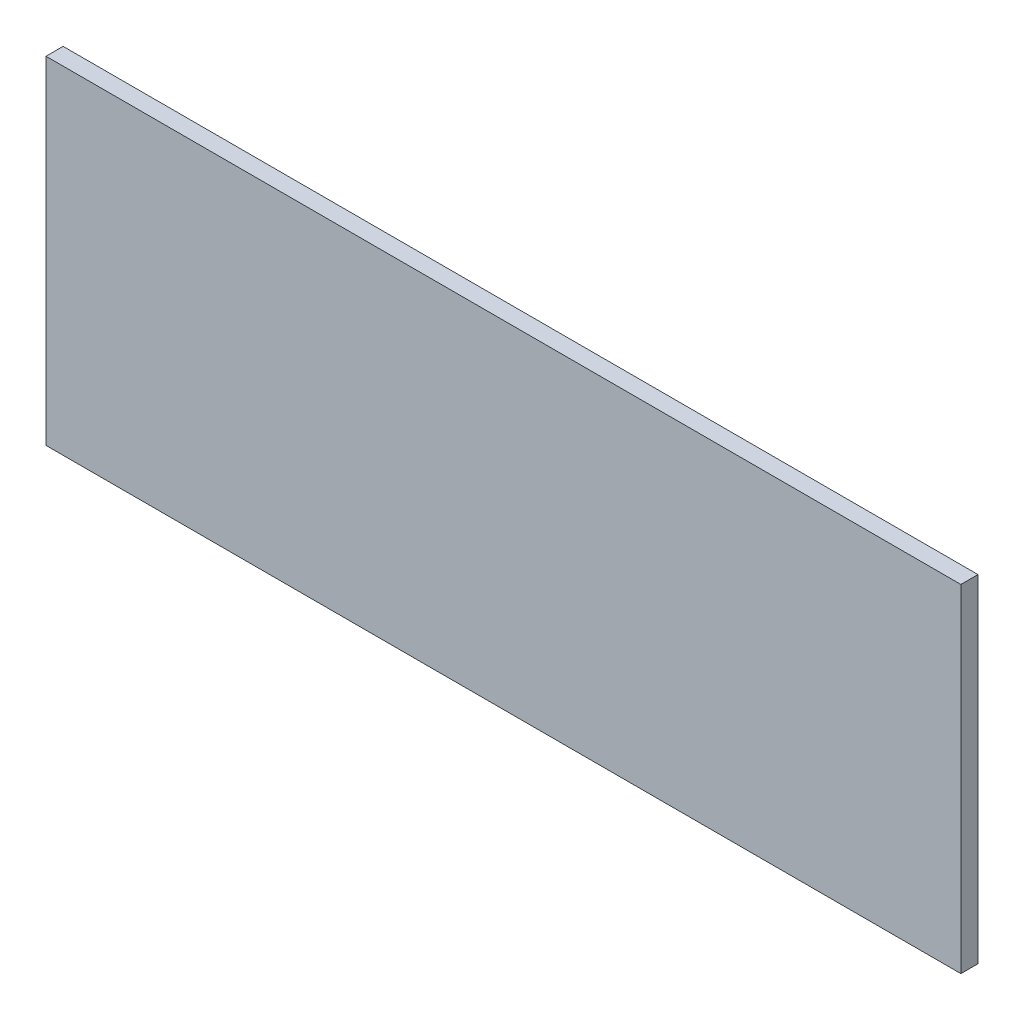
ISO-10303-21;
HEADER;
FILE_DESCRIPTION(('STEP AP214'),'2;1');
FILE_NAME('part.step','',(''),(''),'','','');
FILE_SCHEMA(('AUTOMOTIVE_DESIGN { 1 0 10303 214 1 1 1 1 }'));
ENDSEC;
DATA;
#1=APPLICATION_CONTEXT('core data for automotive mechanical design processes');
#2=APPLICATION_PROTOCOL_DEFINITION('international standard','automotive_design',2000,#1);
#3=PRODUCT_CONTEXT('',#1,'mechanical');
#4=PRODUCT('Part','Part','',(#3));
#5=PRODUCT_RELATED_PRODUCT_CATEGORY('part','',(#4));
#6=PRODUCT_DEFINITION_FORMATION('','',#4);
#7=PRODUCT_DEFINITION_CONTEXT('part definition',#1,'design');
#8=PRODUCT_DEFINITION('design','',#6,#7);
#9=PRODUCT_DEFINITION_SHAPE('','',#8);
#10=(LENGTH_UNIT() NAMED_UNIT(*) SI_UNIT(.MILLI.,.METRE.));
#11=(NAMED_UNIT(*) PLANE_ANGLE_UNIT() SI_UNIT($,.RADIAN.));
#12=(NAMED_UNIT(*) SI_UNIT($,.STERADIAN.) SOLID_ANGLE_UNIT());
#13=UNCERTAINTY_MEASURE_WITH_UNIT(LENGTH_MEASURE(1.E-05),#10,'distance_accuracy_value','');
#14=(GEOMETRIC_REPRESENTATION_CONTEXT(3) GLOBAL_UNCERTAINTY_ASSIGNED_CONTEXT((#13)) GLOBAL_UNIT_ASSIGNED_CONTEXT((#10,
#11,#12)) REPRESENTATION_CONTEXT('',''));
#15=CARTESIAN_POINT('',(0.,0.,0.));
#16=DIRECTION('',(0.,0.,1.));
#17=DIRECTION('',(1.,0.,0.));
#18=AXIS2_PLACEMENT_3D('',#15,#16,#17);
#19=CARTESIAN_POINT('',(96.5670013427734,62.5870018005371,0.));
#20=DIRECTION('',(0.,1.,0.));
#21=DIRECTION('',(1.,0.,0.));
#22=AXIS2_PLACEMENT_3D('',#19,#20,#21);
#23=PLANE('',#22);
#24=DIRECTION('',(1.,0.,0.));
#25=VECTOR('',#24,1.);
#26=CARTESIAN_POINT('',(96.5670013427734,62.5870018005371,0.03556));
#27=LINE('',#26,#25);
#28=CARTESIAN_POINT('',(96.5670013427734,62.5870018005371,0.03556));
#29=VERTEX_POINT('',#28);
#30=CARTESIAN_POINT('',(98.4670028686523,62.5870018005371,0.03556));
#31=VERTEX_POINT('',#30);
#32=EDGE_CURVE('E11',#29,#31,#27,.T.);
#33=ORIENTED_EDGE('',*,*,#32,.F.);
#34=DIRECTION('',(0.,0.,1.));
#35=VECTOR('',#34,1.);
#36=CARTESIAN_POINT('',(96.5670013427734,62.5870018005371,0.));
#37=LINE('',#36,#35);
#38=CARTESIAN_POINT('',(96.5670013427734,62.5870018005371,0.));
#39=VERTEX_POINT('',#38);
#40=EDGE_CURVE('E24',#39,#29,#37,.T.);
#41=ORIENTED_EDGE('',*,*,#40,.F.);
#42=DIRECTION('',(1.,0.,0.));
#43=VECTOR('',#42,1.);
#44=CARTESIAN_POINT('',(96.5670013427734,62.5870018005371,0.));
#45=LINE('',#44,#43);
#46=CARTESIAN_POINT('',(98.4670028686523,62.5870018005371,0.));
#47=VERTEX_POINT('',#46);
#48=EDGE_CURVE('E75',#39,#47,#45,.T.);
#49=ORIENTED_EDGE('',*,*,#48,.T.);
#50=DIRECTION('',(0.,0.,1.));
#51=VECTOR('',#50,1.);
#52=CARTESIAN_POINT('',(98.4670028686523,62.5870018005371,0.));
#53=LINE('',#52,#51);
#54=EDGE_CURVE('E37',#47,#31,#53,.T.);
#55=ORIENTED_EDGE('',*,*,#54,.T.);
#56=EDGE_LOOP('',(#33,#41,#49,#55));
#57=FACE_BOUND('',#56,.T.);
#58=ADVANCED_FACE('F17',(#57),#23,.F.);
#59=CARTESIAN_POINT('',(98.4670028686523,62.5870018005371,0.));
#60=DIRECTION('',(-1.,0.,0.));
#61=DIRECTION('',(0.,1.,0.));
#62=AXIS2_PLACEMENT_3D('',#59,#60,#61);
#63=PLANE('',#62);
#64=DIRECTION('',(0.,1.,0.));
#65=VECTOR('',#64,1.);
#66=CARTESIAN_POINT('',(98.4670028686523,62.5870018005371,0.03556));
#67=LINE('',#66,#65);
#68=CARTESIAN_POINT('',(98.4670028686523,63.2869987487793,0.03556));
#69=VERTEX_POINT('',#68);
#70=EDGE_CURVE('E83',#31,#69,#67,.T.);
#71=ORIENTED_EDGE('',*,*,#70,.F.);
#72=ORIENTED_EDGE('',*,*,#54,.F.);
#73=DIRECTION('',(0.,1.,0.));
#74=VECTOR('',#73,1.);
#75=CARTESIAN_POINT('',(98.4670028686523,62.5870018005371,0.));
#76=LINE('',#75,#74);
#77=CARTESIAN_POINT('',(98.4670028686523,63.2869987487793,0.));
#78=VERTEX_POINT('',#77);
#79=EDGE_CURVE('E81',#47,#78,#76,.T.);
#80=ORIENTED_EDGE('',*,*,#79,.T.);
#81=DIRECTION('',(0.,0.,1.));
#82=VECTOR('',#81,1.);
#83=CARTESIAN_POINT('',(98.4670028686523,63.2869987487793,0.));
#84=LINE('',#83,#82);
#85=EDGE_CURVE('E67',#78,#69,#84,.T.);
#86=ORIENTED_EDGE('',*,*,#85,.T.);
#87=EDGE_LOOP('',(#71,#72,#80,#86));
#88=FACE_BOUND('',#87,.T.);
#89=ADVANCED_FACE('F89',(#88),#63,.F.);
#90=CARTESIAN_POINT('',(98.4670028686523,63.2869987487793,0.));
#91=DIRECTION('',(0.,-1.,0.));
#92=DIRECTION('',(-1.,0.,0.));
#93=AXIS2_PLACEMENT_3D('',#90,#91,#92);
#94=PLANE('',#93);
#95=DIRECTION('',(-1.,0.,0.));
#96=VECTOR('',#95,1.);
#97=CARTESIAN_POINT('',(98.4670028686523,63.2869987487793,0.03556));
#98=LINE('',#97,#96);
#99=CARTESIAN_POINT('',(96.5670013427734,63.2869987487793,0.03556));
#100=VERTEX_POINT('',#99);
#101=EDGE_CURVE('E71',#69,#100,#98,.T.);
#102=ORIENTED_EDGE('',*,*,#101,.F.);
#103=ORIENTED_EDGE('',*,*,#85,.F.);
#104=DIRECTION('',(-1.,0.,0.));
#105=VECTOR('',#104,1.);
#106=CARTESIAN_POINT('',(98.4670028686523,63.2869987487793,0.));
#107=LINE('',#106,#105);
#108=CARTESIAN_POINT('',(96.5670013427734,63.2869987487793,0.));
#109=VERTEX_POINT('',#108);
#110=EDGE_CURVE('E63',#78,#109,#107,.T.);
#111=ORIENTED_EDGE('',*,*,#110,.T.);
#112=DIRECTION('',(0.,0.,1.));
#113=VECTOR('',#112,1.);
#114=CARTESIAN_POINT('',(96.5670013427734,63.2869987487793,0.));
#115=LINE('',#114,#113);
#116=EDGE_CURVE('E53',#109,#100,#115,.T.);
#117=ORIENTED_EDGE('',*,*,#116,.T.);
#118=EDGE_LOOP('',(#102,#103,#111,#117));
#119=FACE_BOUND('',#118,.T.);
#120=ADVANCED_FACE('F66',(#119),#94,.F.);
#121=CARTESIAN_POINT('',(96.5670013427734,63.2869987487793,0.));
#122=DIRECTION('',(1.,0.,0.));
#123=DIRECTION('',(0.,-1.,0.));
#124=AXIS2_PLACEMENT_3D('',#121,#122,#123);
#125=PLANE('',#124);
#126=DIRECTION('',(0.,-1.,0.));
#127=VECTOR('',#126,1.);
#128=CARTESIAN_POINT('',(96.5670013427734,63.2869987487793,0.03556));
#129=LINE('',#128,#127);
#130=EDGE_CURVE('E59',#100,#29,#129,.T.);
#131=ORIENTED_EDGE('',*,*,#130,.F.);
#132=ORIENTED_EDGE('',*,*,#116,.F.);
#133=DIRECTION('',(0.,-1.,0.));
#134=VECTOR('',#133,1.);
#135=CARTESIAN_POINT('',(96.5670013427734,63.2869987487793,0.));
#136=LINE('',#135,#134);
#137=EDGE_CURVE('E57',#109,#39,#136,.T.);
#138=ORIENTED_EDGE('',*,*,#137,.T.);
#139=ORIENTED_EDGE('',*,*,#40,.T.);
#140=EDGE_LOOP('',(#131,#132,#138,#139));
#141=FACE_BOUND('',#140,.T.);
#142=ADVANCED_FACE('F55',(#141),#125,.F.);
#143=CARTESIAN_POINT('',(96.5670013427734,62.5870018005371,0.));
#144=DIRECTION('',(0.,0.,-1.));
#145=DIRECTION('',(-1.,0.,0.));
#146=AXIS2_PLACEMENT_3D('',#143,#144,#145);
#147=PLANE('',#146);
#148=ORIENTED_EDGE('',*,*,#137,.F.);
#149=ORIENTED_EDGE('',*,*,#110,.F.);
#150=ORIENTED_EDGE('',*,*,#79,.F.);
#151=ORIENTED_EDGE('',*,*,#48,.F.);
#152=EDGE_LOOP('',(#148,#149,#150,#151));
#153=FACE_BOUND('',#152,.T.);
#154=ADVANCED_FACE('F74',(#153),#147,.T.);
#155=CARTESIAN_POINT('',(96.5670013427734,62.5870018005371,0.03556));
#156=DIRECTION('',(0.,0.,-1.));
#157=DIRECTION('',(-1.,0.,0.));
#158=AXIS2_PLACEMENT_3D('',#155,#156,#157);
#159=PLANE('',#158);
#160=ORIENTED_EDGE('',*,*,#32,.T.);
#161=ORIENTED_EDGE('',*,*,#70,.T.);
#162=ORIENTED_EDGE('',*,*,#101,.T.);
#163=ORIENTED_EDGE('',*,*,#130,.T.);
#164=EDGE_LOOP('',(#160,#161,#162,#163));
#165=FACE_BOUND('',#164,.T.);
#166=ADVANCED_FACE('F91',(#165),#159,.F.);
#167=CLOSED_SHELL('',(#58,#89,#120,#142,#154,#166));
#168=MANIFOLD_SOLID_BREP('B1',#167);
#169=ADVANCED_BREP_SHAPE_REPRESENTATION('',(#18,#168),#14);
#170=SHAPE_DEFINITION_REPRESENTATION(#9,#169);
ENDSEC;
END-ISO-10303-21;
